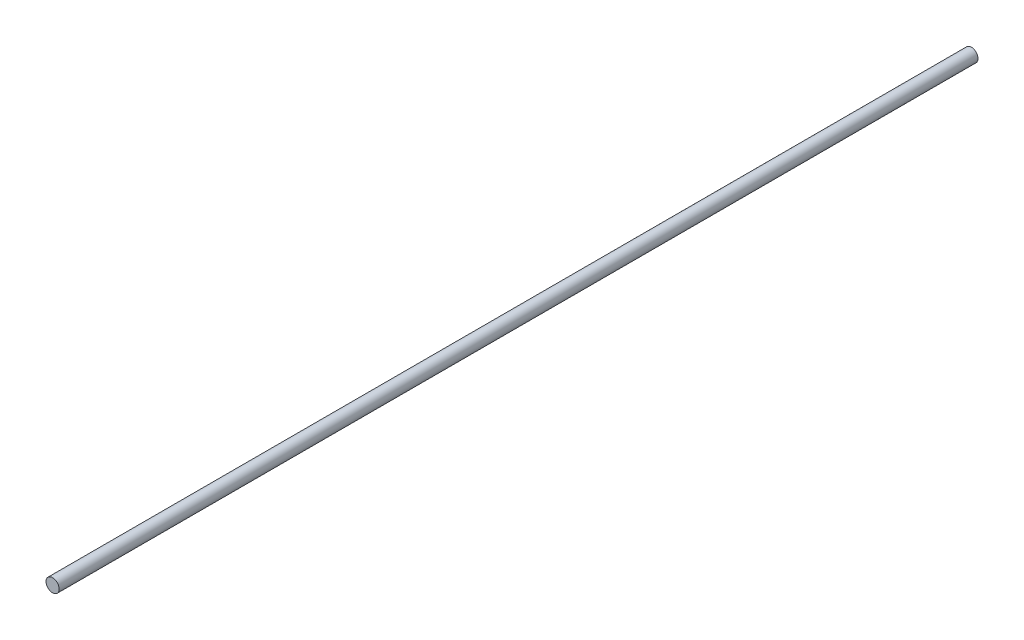
ISO-10303-21;
HEADER;
FILE_DESCRIPTION(('STEP AP214'),'2;1');
FILE_NAME('part.step','',(''),(''),'','','');
FILE_SCHEMA(('AUTOMOTIVE_DESIGN { 1 0 10303 214 1 1 1 1 }'));
ENDSEC;
DATA;
#1=APPLICATION_CONTEXT('core data for automotive mechanical design processes');
#2=APPLICATION_PROTOCOL_DEFINITION('international standard','automotive_design',2000,#1);
#3=PRODUCT_CONTEXT('',#1,'mechanical');
#4=PRODUCT('Part','Part','',(#3));
#5=PRODUCT_RELATED_PRODUCT_CATEGORY('part','',(#4));
#6=PRODUCT_DEFINITION_FORMATION('','',#4);
#7=PRODUCT_DEFINITION_CONTEXT('part definition',#1,'design');
#8=PRODUCT_DEFINITION('design','',#6,#7);
#9=PRODUCT_DEFINITION_SHAPE('','',#8);
#10=(LENGTH_UNIT() NAMED_UNIT(*) SI_UNIT(.MILLI.,.METRE.));
#11=(NAMED_UNIT(*) PLANE_ANGLE_UNIT() SI_UNIT($,.RADIAN.));
#12=(NAMED_UNIT(*) SI_UNIT($,.STERADIAN.) SOLID_ANGLE_UNIT());
#13=UNCERTAINTY_MEASURE_WITH_UNIT(LENGTH_MEASURE(1.E-05),#10,'distance_accuracy_value','');
#14=(GEOMETRIC_REPRESENTATION_CONTEXT(3) GLOBAL_UNCERTAINTY_ASSIGNED_CONTEXT((#13)) GLOBAL_UNIT_ASSIGNED_CONTEXT((#10,
#11,#12)) REPRESENTATION_CONTEXT('',''));
#15=CARTESIAN_POINT('',(0.,0.,0.));
#16=DIRECTION('',(0.,0.,1.));
#17=DIRECTION('',(1.,0.,0.));
#18=AXIS2_PLACEMENT_3D('',#15,#16,#17);
#19=CARTESIAN_POINT('',(0.,0.,558.8));
#20=DIRECTION('',(0.,0.,-1.));
#21=DIRECTION('',(-1.,0.,0.));
#22=AXIS2_PLACEMENT_3D('',#19,#20,#21);
#23=CYLINDRICAL_SURFACE('',#22,4.);
#24=CARTESIAN_POINT('',(0.,0.,558.8));
#25=DIRECTION('',(0.,0.,1.));
#26=DIRECTION('',(1.,0.,0.));
#27=AXIS2_PLACEMENT_3D('',#24,#25,#26);
#28=CIRCLE('',#27,4.);
#29=CARTESIAN_POINT('',(4.,0.,558.8));
#30=VERTEX_POINT('',#29);
#31=EDGE_CURVE('E10',#30,#30,#28,.T.);
#32=ORIENTED_EDGE('',*,*,#31,.F.);
#33=EDGE_LOOP('',(#32));
#34=FACE_BOUND('',#33,.T.);
#35=CARTESIAN_POINT('',(0.,0.,0.));
#36=DIRECTION('',(0.,0.,1.));
#37=DIRECTION('',(1.,0.,0.));
#38=AXIS2_PLACEMENT_3D('',#35,#36,#37);
#39=CIRCLE('',#38,4.);
#40=CARTESIAN_POINT('',(4.,0.,0.));
#41=VERTEX_POINT('',#40);
#42=EDGE_CURVE('E33',#41,#41,#39,.T.);
#43=ORIENTED_EDGE('',*,*,#42,.T.);
#44=EDGE_LOOP('',(#43));
#45=FACE_BOUND('',#44,.T.);
#46=ADVANCED_FACE('F30',(#34,#45),#23,.T.);
#47=CARTESIAN_POINT('',(0.,0.,558.8));
#48=DIRECTION('',(0.,0.,1.));
#49=DIRECTION('',(1.,0.,0.));
#50=AXIS2_PLACEMENT_3D('',#47,#48,#49);
#51=PLANE('',#50);
#52=ORIENTED_EDGE('',*,*,#31,.T.);
#53=EDGE_LOOP('',(#52));
#54=FACE_BOUND('',#53,.T.);
#55=ADVANCED_FACE('F45',(#54),#51,.T.);
#56=CARTESIAN_POINT('',(0.,0.,0.));
#57=DIRECTION('',(0.,0.,1.));
#58=DIRECTION('',(1.,0.,0.));
#59=AXIS2_PLACEMENT_3D('',#56,#57,#58);
#60=PLANE('',#59);
#61=ORIENTED_EDGE('',*,*,#42,.F.);
#62=EDGE_LOOP('',(#61));
#63=FACE_BOUND('',#62,.T.);
#64=ADVANCED_FACE('F43',(#63),#60,.F.);
#65=CLOSED_SHELL('',(#46,#55,#64));
#66=MANIFOLD_SOLID_BREP('B2',#65);
#67=ADVANCED_BREP_SHAPE_REPRESENTATION('',(#18,#66),#14);
#68=SHAPE_DEFINITION_REPRESENTATION(#9,#67);
ENDSEC;
END-ISO-10303-21;
